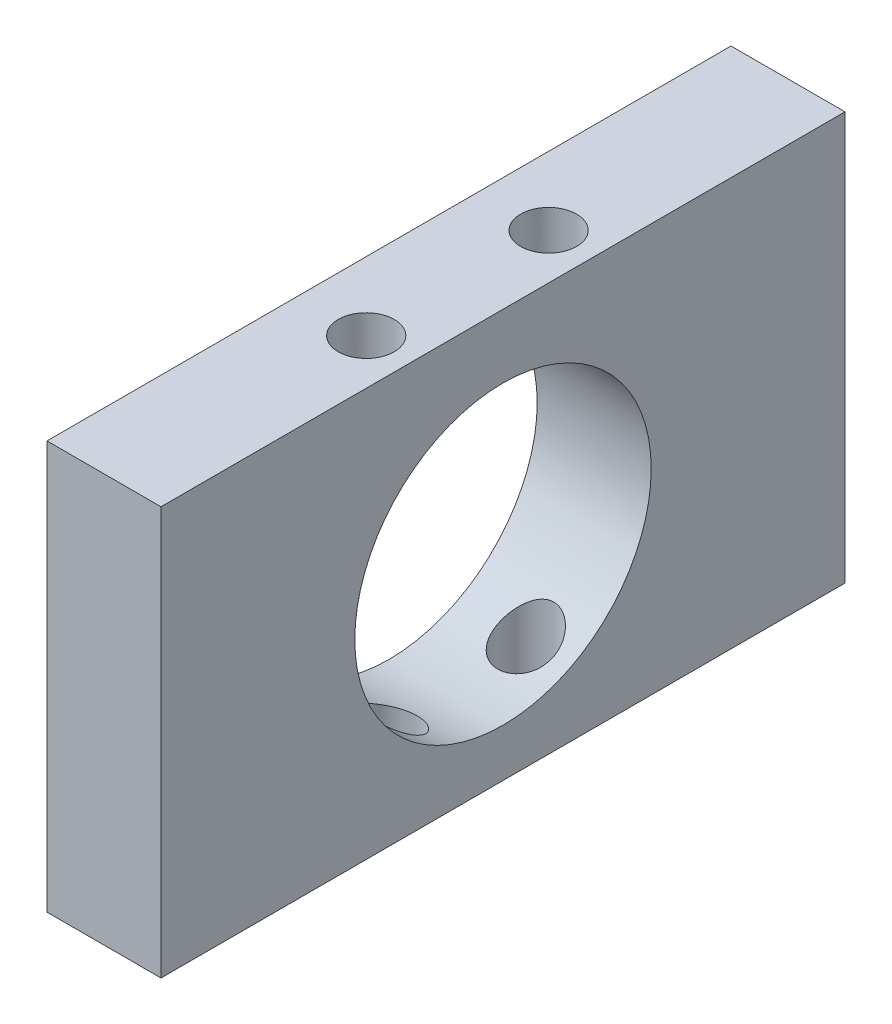
ISO-10303-21;
HEADER;
FILE_DESCRIPTION(('STEP AP214'),'2;1');
FILE_NAME('part.step','',(''),(''),'','','');
FILE_SCHEMA(('AUTOMOTIVE_DESIGN { 1 0 10303 214 1 1 1 1 }'));
ENDSEC;
DATA;
#1=APPLICATION_CONTEXT('core data for automotive mechanical design processes');
#2=APPLICATION_PROTOCOL_DEFINITION('international standard','automotive_design',2000,#1);
#3=PRODUCT_CONTEXT('',#1,'mechanical');
#4=PRODUCT('Part','Part','',(#3));
#5=PRODUCT_RELATED_PRODUCT_CATEGORY('part','',(#4));
#6=PRODUCT_DEFINITION_FORMATION('','',#4);
#7=PRODUCT_DEFINITION_CONTEXT('part definition',#1,'design');
#8=PRODUCT_DEFINITION('design','',#6,#7);
#9=PRODUCT_DEFINITION_SHAPE('','',#8);
#10=(LENGTH_UNIT() NAMED_UNIT(*) SI_UNIT(.MILLI.,.METRE.));
#11=(NAMED_UNIT(*) PLANE_ANGLE_UNIT() SI_UNIT($,.RADIAN.));
#12=(NAMED_UNIT(*) SI_UNIT($,.STERADIAN.) SOLID_ANGLE_UNIT());
#13=UNCERTAINTY_MEASURE_WITH_UNIT(LENGTH_MEASURE(1.E-05),#10,'distance_accuracy_value','');
#14=(GEOMETRIC_REPRESENTATION_CONTEXT(3) GLOBAL_UNCERTAINTY_ASSIGNED_CONTEXT((#13)) GLOBAL_UNIT_ASSIGNED_CONTEXT((#10,
#11,#12)) REPRESENTATION_CONTEXT('',''));
#15=CARTESIAN_POINT('',(0.,0.,0.));
#16=DIRECTION('',(0.,0.,1.));
#17=DIRECTION('',(1.,0.,0.));
#18=AXIS2_PLACEMENT_3D('',#15,#16,#17);
#19=CARTESIAN_POINT('',(0.5,-3.09999999990396,4.));
#20=DIRECTION('',(0.,-1.,0.));
#21=DIRECTION('',(0.,0.,-1.));
#22=AXIS2_PLACEMENT_3D('',#19,#20,#21);
#23=CONICAL_SURFACE('',#22,1.22949999978669,1.04719755081557);
#24=CARTESIAN_POINT('',(0.5,-3.1,4.));
#25=DIRECTION('',(0.,1.,0.));
#26=DIRECTION('',(0.,0.,1.));
#27=AXIS2_PLACEMENT_3D('',#24,#25,#26);
#28=CIRCLE('',#27,1.2295);
#29=CARTESIAN_POINT('',(0.5,-3.1,5.2295));
#30=VERTEX_POINT('',#29);
#31=EDGE_CURVE('E179',#30,#30,#28,.F.);
#32=ORIENTED_EDGE('',*,*,#31,.T.);
#33=EDGE_LOOP('',(#32));
#34=FACE_BOUND('',#33,.T.);
#35=CARTESIAN_POINT('',(0.500000000028422,-2.39014784395408,3.99999999997158));
#36=VERTEX_POINT('',#35);
#37=VERTEX_LOOP('',#36);
#38=FACE_BOUND('',#37,.T.);
#39=ADVANCED_FACE('F17',(#34,#38),#23,.F.);
#40=CARTESIAN_POINT('',(0.5,-3.10000000001764,26.));
#41=DIRECTION('',(0.,-1.,0.));
#42=DIRECTION('',(0.,0.,-1.));
#43=AXIS2_PLACEMENT_3D('',#40,#41,#42);
#44=CONICAL_SURFACE('',#43,1.22949999999499,1.04719755118339);
#45=CARTESIAN_POINT('',(0.5,-3.1,26.));
#46=DIRECTION('',(0.,1.,0.));
#47=DIRECTION('',(0.,0.,1.));
#48=AXIS2_PLACEMENT_3D('',#45,#46,#47);
#49=CIRCLE('',#48,1.2295);
#50=CARTESIAN_POINT('',(0.5,-3.1,27.2295));
#51=VERTEX_POINT('',#50);
#52=EDGE_CURVE('E173',#51,#51,#49,.F.);
#53=ORIENTED_EDGE('',*,*,#52,.T.);
#54=EDGE_LOOP('',(#53));
#55=FACE_BOUND('',#54,.T.);
#56=CARTESIAN_POINT('',(0.5,-2.39014784403935,26.));
#57=VERTEX_POINT('',#56);
#58=VERTEX_LOOP('',#57);
#59=FACE_BOUND('',#58,.T.);
#60=ADVANCED_FACE('F69',(#55,#59),#44,.F.);
#61=CARTESIAN_POINT('',(0.,-1.,6.49999999995998));
#62=DIRECTION('',(0.,0.,-1.));
#63=DIRECTION('',(-1.,0.,0.));
#64=AXIS2_PLACEMENT_3D('',#61,#62,#63);
#65=CONICAL_SURFACE('',#64,0.783500000045757,1.04719755121255);
#66=CARTESIAN_POINT('',(0.,-1.,6.5));
#67=DIRECTION('',(0.,0.,1.));
#68=DIRECTION('',(1.,0.,0.));
#69=AXIS2_PLACEMENT_3D('',#66,#67,#68);
#70=CIRCLE('',#69,0.7835);
#71=CARTESIAN_POINT('',(0.7835,-1.,6.5));
#72=VERTEX_POINT('',#71);
#73=EDGE_CURVE('E171',#72,#72,#70,.F.);
#74=ORIENTED_EDGE('',*,*,#73,.T.);
#75=EDGE_LOOP('',(#74));
#76=FACE_BOUND('',#75,.T.);
#77=CARTESIAN_POINT('',(-8.52651303692523E-11,-1.00000000002842,6.9523539359011));
#78=VERTEX_POINT('',#77);
#79=VERTEX_LOOP('',#78);
#80=FACE_BOUND('',#79,.T.);
#81=ADVANCED_FACE('F74',(#76,#80),#65,.F.);
#82=CARTESIAN_POINT('',(0.,6.,6.50000000001683));
#83=DIRECTION('',(0.,0.,-1.));
#84=DIRECTION('',(0.,1.,0.));
#85=AXIS2_PLACEMENT_3D('',#82,#83,#84);
#86=CONICAL_SURFACE('',#85,0.783499999921133,1.04719755093472);
#87=CARTESIAN_POINT('',(0.,6.,6.5));
#88=DIRECTION('',(0.,0.,1.));
#89=DIRECTION('',(1.,0.,0.));
#90=AXIS2_PLACEMENT_3D('',#87,#88,#89);
#91=CIRCLE('',#90,0.7835);
#92=CARTESIAN_POINT('',(0.7835,6.,6.5));
#93=VERTEX_POINT('',#92);
#94=EDGE_CURVE('E172',#93,#93,#91,.F.);
#95=ORIENTED_EDGE('',*,*,#94,.T.);
#96=EDGE_LOOP('',(#95));
#97=FACE_BOUND('',#96,.T.);
#98=CARTESIAN_POINT('',(0.,6.,6.95235393595794));
#99=VERTEX_POINT('',#98);
#100=VERTEX_LOOP('',#99);
#101=FACE_BOUND('',#100,.T.);
#102=ADVANCED_FACE('F159',(#97,#101),#86,.F.);
#103=CARTESIAN_POINT('',(0.5,-8.5,4.));
#104=DIRECTION('',(0.,1.,0.));
#105=DIRECTION('',(0.,0.,1.));
#106=AXIS2_PLACEMENT_3D('',#103,#104,#105);
#107=CYLINDRICAL_SURFACE('',#106,1.2295);
#108=ORIENTED_EDGE('',*,*,#31,.F.);
#109=EDGE_LOOP('',(#108));
#110=FACE_BOUND('',#109,.T.);
#111=CARTESIAN_POINT('',(0.5,-8.6,4.));
#112=DIRECTION('',(0.,1.,0.));
#113=DIRECTION('',(0.,0.,1.));
#114=AXIS2_PLACEMENT_3D('',#111,#112,#113);
#115=CIRCLE('',#114,1.2295);
#116=CARTESIAN_POINT('',(0.5,-8.6,5.2295));
#117=VERTEX_POINT('',#116);
#118=EDGE_CURVE('E20',#117,#117,#115,.T.);
#119=ORIENTED_EDGE('',*,*,#118,.F.);
#120=EDGE_LOOP('',(#119));
#121=FACE_BOUND('',#120,.T.);
#122=ADVANCED_FACE('F155',(#110,#121),#107,.F.);
#123=CARTESIAN_POINT('',(0.5,-8.5,26.));
#124=DIRECTION('',(0.,1.,0.));
#125=DIRECTION('',(0.,0.,1.));
#126=AXIS2_PLACEMENT_3D('',#123,#124,#125);
#127=CYLINDRICAL_SURFACE('',#126,1.2295);
#128=ORIENTED_EDGE('',*,*,#52,.F.);
#129=EDGE_LOOP('',(#128));
#130=FACE_BOUND('',#129,.T.);
#131=CARTESIAN_POINT('',(0.5,-8.6,26.));
#132=DIRECTION('',(0.,1.,0.));
#133=DIRECTION('',(0.,0.,1.));
#134=AXIS2_PLACEMENT_3D('',#131,#132,#133);
#135=CIRCLE('',#134,1.2295);
#136=CARTESIAN_POINT('',(0.5,-8.6,27.2295));
#137=VERTEX_POINT('',#136);
#138=EDGE_CURVE('E189',#137,#137,#135,.T.);
#139=ORIENTED_EDGE('',*,*,#138,.F.);
#140=EDGE_LOOP('',(#139));
#141=FACE_BOUND('',#140,.T.);
#142=ADVANCED_FACE('F151',(#130,#141),#127,.F.);
#143=CARTESIAN_POINT('',(0.,-1.,0.1));
#144=DIRECTION('',(0.,0.,1.));
#145=DIRECTION('',(1.,0.,0.));
#146=AXIS2_PLACEMENT_3D('',#143,#144,#145);
#147=CYLINDRICAL_SURFACE('',#146,0.7835);
#148=ORIENTED_EDGE('',*,*,#73,.F.);
#149=EDGE_LOOP('',(#148));
#150=FACE_BOUND('',#149,.T.);
#151=CARTESIAN_POINT('',(0.,-1.,0.));
#152=DIRECTION('',(0.,0.,1.));
#153=DIRECTION('',(1.,0.,0.));
#154=AXIS2_PLACEMENT_3D('',#151,#152,#153);
#155=CIRCLE('',#154,0.7835);
#156=CARTESIAN_POINT('',(0.7835,-1.,0.));
#157=VERTEX_POINT('',#156);
#158=EDGE_CURVE('E200',#157,#157,#155,.F.);
#159=ORIENTED_EDGE('',*,*,#158,.T.);
#160=EDGE_LOOP('',(#159));
#161=FACE_BOUND('',#160,.T.);
#162=ADVANCED_FACE('F147',(#150,#161),#147,.F.);
#163=CARTESIAN_POINT('',(0.,6.,0.1));
#164=DIRECTION('',(0.,0.,1.));
#165=DIRECTION('',(1.,0.,0.));
#166=AXIS2_PLACEMENT_3D('',#163,#164,#165);
#167=CYLINDRICAL_SURFACE('',#166,0.7835);
#168=ORIENTED_EDGE('',*,*,#94,.F.);
#169=EDGE_LOOP('',(#168));
#170=FACE_BOUND('',#169,.T.);
#171=CARTESIAN_POINT('',(0.,6.,0.));
#172=DIRECTION('',(0.,0.,1.));
#173=DIRECTION('',(1.,0.,0.));
#174=AXIS2_PLACEMENT_3D('',#171,#172,#173);
#175=CIRCLE('',#174,0.7835);
#176=CARTESIAN_POINT('',(0.7835,6.,0.));
#177=VERTEX_POINT('',#176);
#178=EDGE_CURVE('E205',#177,#177,#175,.F.);
#179=ORIENTED_EDGE('',*,*,#178,.T.);
#180=EDGE_LOOP('',(#179));
#181=FACE_BOUND('',#180,.T.);
#182=ADVANCED_FACE('F143',(#170,#181),#167,.F.);
#183=CARTESIAN_POINT('',(0.5,-8.5,12.));
#184=DIRECTION('',(0.,1.,0.));
#185=DIRECTION('',(0.,0.,1.));
#186=AXIS2_PLACEMENT_3D('',#183,#184,#185);
#187=CYLINDRICAL_SURFACE('',#186,1.2295);
#188=CARTESIAN_POINT('',(0.5,-8.6,12.));
#189=DIRECTION('',(0.,1.,0.));
#190=DIRECTION('',(0.,0.,1.));
#191=AXIS2_PLACEMENT_3D('',#188,#189,#190);
#192=CIRCLE('',#191,1.2295);
#193=CARTESIAN_POINT('',(0.5,-8.6,13.2295));
#194=VERTEX_POINT('',#193);
#195=EDGE_CURVE('E187',#194,#194,#192,.T.);
#196=ORIENTED_EDGE('',*,*,#195,.F.);
#197=EDGE_LOOP('',(#196));
#198=FACE_BOUND('',#197,.T.);
#199=CARTESIAN_POINT('',(1.57898775984839,-5.41902409458247,11.4105463002938));
#200=CARTESIAN_POINT('',(1.54350432210785,-5.37599821195079,11.3455925201877));
#201=CARTESIAN_POINT('',(1.50204506316841,-5.33326068973784,11.2836253624419));
#202=CARTESIAN_POINT('',(1.40757477362818,-5.25019426157183,11.1671706197702));
#203=CARTESIAN_POINT('',(1.35455410070056,-5.2098674021196,11.1126893403358));
#204=CARTESIAN_POINT('',(1.24864924326198,-5.14139341362122,11.022735600131));
#205=CARTESIAN_POINT('',(1.19771083739972,-5.1123972583103,10.9856235285672));
#206=CARTESIAN_POINT('',(1.08891989363457,-5.05924619660192,10.9188425524561));
#207=CARTESIAN_POINT('',(1.03107957831365,-5.03508292897328,10.8891607702044));
#208=CARTESIAN_POINT('',(0.920263419551336,-4.99725015926502,10.8432927666009));
#209=CARTESIAN_POINT('',(0.868275646137892,-4.98247584655016,10.8256408736812));
#210=CARTESIAN_POINT('',(0.76118263886178,-4.95858511096861,10.7972888123839));
#211=CARTESIAN_POINT('',(0.706079654882526,-4.9494646602919,10.7865836948702));
#212=CARTESIAN_POINT('',(0.593968995715319,-4.9376908760812,10.7727910059167));
#213=CARTESIAN_POINT('',(0.536953813354866,-4.93506707089065,10.7697382148104));
#214=CARTESIAN_POINT('',(0.423148097071325,-4.93664986546514,10.7715854863549));
#215=CARTESIAN_POINT('',(0.366357562570627,-4.94085644765658,10.7764855285442));
#216=CARTESIAN_POINT('',(0.258843048875742,-4.95512840061852,10.7932425007076));
#217=CARTESIAN_POINT('',(0.207975639780494,-4.9647533585245,10.804576957771));
#218=CARTESIAN_POINT('',(0.109123056898987,-4.98875932552672,10.8331515058891));
#219=CARTESIAN_POINT('',(0.0611387463715604,-5.00314175080315,10.8503933554828));
#220=CARTESIAN_POINT('',(-0.0357126065090727,-5.03735064492044,10.8919727224218));
#221=CARTESIAN_POINT('',(-0.0842118191907645,-5.0575704806824,10.9168371658984));
#222=CARTESIAN_POINT('',(-0.176367164746679,-5.10149846874345,10.9718547964386));
#223=CARTESIAN_POINT('',(-0.220020588435676,-5.12520855531499,11.0020109179043));
#224=CARTESIAN_POINT('',(-0.311029574990962,-5.18044664917986,11.0737513012166));
#225=CARTESIAN_POINT('',(-0.357187379489805,-5.21256327894721,11.1164010474486));
#226=CARTESIAN_POINT('',(-0.44182626541927,-5.27901796857915,11.2072246169204));
#227=CARTESIAN_POINT('',(-0.480301539485361,-5.31335768314416,11.2554025760446));
#228=CARTESIAN_POINT('',(-0.55651916290933,-5.39032989383123,11.3668451915277));
#229=CARTESIAN_POINT('',(-0.592470082266699,-5.43321073608699,11.4311710053382));
#230=CARTESIAN_POINT('',(-0.652410668592677,-5.51894600940814,11.5652397263585));
#231=CARTESIAN_POINT('',(-0.676391423278033,-5.56180039713848,11.6349866252724));
#232=CARTESIAN_POINT('',(-0.713133306555228,-5.64971478565478,11.7845897382531));
#233=CARTESIAN_POINT('',(-0.724765172778964,-5.69465186497651,11.8648010546297));
#234=CARTESIAN_POINT('',(-0.73188130826498,-5.7813105835457,12.0276392102505));
#235=CARTESIAN_POINT('',(-0.727379400054598,-5.82303494397735,12.1102639216551));
#236=CARTESIAN_POINT('',(-0.703550442095634,-5.89498833167978,12.2605107240223));
#237=CARTESIAN_POINT('',(-0.68696436206692,-5.92594957363092,12.3282204885315));
#238=CARTESIAN_POINT('',(-0.641866650594575,-5.98413611813288,12.461226869342));
#239=CARTESIAN_POINT('',(-0.613364570008473,-6.01136438955876,12.5265253727893));
#240=CARTESIAN_POINT('',(-0.547362796767616,-6.05961306624789,12.647344644393));
#241=CARTESIAN_POINT('',(-0.51076599782364,-6.08095593147471,12.7032296876123));
#242=CARTESIAN_POINT('',(-0.428195515355715,-6.11989324846667,12.8090894755991));
#243=CARTESIAN_POINT('',(-0.382222794309946,-6.13748808460418,12.8590648261904));
#244=CARTESIAN_POINT('',(-0.281841423266512,-6.16890478324075,12.9513415635376));
#245=CARTESIAN_POINT('',(-0.227417135405773,-6.18271951786405,12.9936284029268));
#246=CARTESIAN_POINT('',(-0.111667682884761,-6.2066057618282,13.068781073762));
#247=CARTESIAN_POINT('',(-0.0503427672831287,-6.2166774062089,13.1016472450685));
#248=CARTESIAN_POINT('',(0.0753811472161405,-6.23295757483474,13.1558149288152));
#249=CARTESIAN_POINT('',(0.139623877811625,-6.239277133663,13.1774461752801));
#250=CARTESIAN_POINT('',(0.271013177360598,-6.24866092678786,13.2098812675966));
#251=CARTESIAN_POINT('',(0.338159437058305,-6.2517255068888,13.2206862636068));
#252=CARTESIAN_POINT('',(0.472278218445995,-6.25465065472998,13.23099648567));
#253=CARTESIAN_POINT('',(0.539235777749875,-6.25456256308144,13.2306827783367));
#254=CARTESIAN_POINT('',(0.672137920337513,-6.25130720362538,13.2192156195178));
#255=CARTESIAN_POINT('',(0.738082549849662,-6.24814007676645,13.2080626642189));
#256=CARTESIAN_POINT('',(0.866919049053705,-6.23866468975215,13.1753496152046));
#257=CARTESIAN_POINT('',(0.929818281383807,-6.23236446810774,13.1538161588171));
#258=CARTESIAN_POINT('',(1.05099164550827,-6.21650790800161,13.1011102008028));
#259=CARTESIAN_POINT('',(1.10926586093143,-6.20695162843194,13.0699378735145));
#260=CARTESIAN_POINT('',(1.22002806535931,-6.18438182691165,12.9987957670162));
#261=CARTESIAN_POINT('',(1.27247158086911,-6.17134401260534,12.958764524669));
#262=CARTESIAN_POINT('',(1.36977887880723,-6.14177541771875,12.871452519272));
#263=CARTESIAN_POINT('',(1.41464216961134,-6.1252444107398,12.8241712863947));
#264=CARTESIAN_POINT('',(1.49686215820002,-6.08826104166058,12.7227077787526));
#265=CARTESIAN_POINT('',(1.53400105465718,-6.06772031336202,12.6683815560593));
#266=CARTESIAN_POINT('',(1.5987160699721,-6.02318173947681,12.5556277036303));
#267=CARTESIAN_POINT('',(1.62629079913051,-5.99918339220522,12.4971994793445));
#268=CARTESIAN_POINT('',(1.67300182793662,-5.94657170043665,12.3745504629248));
#269=CARTESIAN_POINT('',(1.6915592406161,-5.91777193863258,12.3101899792936));
#270=CARTESIAN_POINT('',(1.71794995279774,-5.85717643428948,12.180672989839));
#271=CARTESIAN_POINT('',(1.72577592942421,-5.82537866177731,12.1155159710377));
#272=CARTESIAN_POINT('',(1.73138502680717,-5.75626345719039,11.9797728666958));
#273=CARTESIAN_POINT('',(1.72813210796464,-5.7187091759983,11.9092659559444));
#274=CARTESIAN_POINT('',(1.70998000822607,-5.64173830125455,11.7709054767745));
#275=CARTESIAN_POINT('',(1.69509044921725,-5.6023232715714,11.7030497648318));
#276=CARTESIAN_POINT('',(1.66260229994343,-5.53872941113296,11.5978538030797));
#277=CARTESIAN_POINT('',(1.64851204611553,-5.51480994808403,11.5592335686854));
#278=CARTESIAN_POINT('',(1.61655880006442,-5.46690538181314,11.4836169853501));
#279=CARTESIAN_POINT('',(1.59869492696981,-5.44292026455814,11.4466210179995));
#280=CARTESIAN_POINT('',(1.57898775984839,-5.41902409458247,11.4105463002938));
#281=B_SPLINE_CURVE_WITH_KNOTS('',3,(#199,#200,#201,#202,#203,#204,#205,#206,#207,#208,#209,
#210,#211,#212,#213,#214,#215,#216,#217,#218,#219,#220,#221,#222,#223,#224,#225,#226,#227,#228,
#229,#230,#231,#232,#233,#234,#235,#236,#237,#238,#239,#240,#241,#242,#243,#244,#245,#246,#247,
#248,#249,#250,#251,#252,#253,#254,#255,#256,#257,#258,#259,#260,#261,#262,#263,#264,#265,#266,
#267,#268,#269,#270,#271,#272,#273,#274,#275,#276,#277,#278,#279,#280),.UNSPECIFIED.,.T.,.F.,(4,
2,2,2,2,2,2,2,2,2,2,2,2,2,2,2,2,2,2,2,2,2,2,2,2,2,2,2,2,2,2,2,2,2,2,2,2,2,2,2,4),(0.,
0.256682893556436,0.513580687453377,0.720933186011389,0.92792378683721,1.09779066198847,
1.26753638452808,1.43805222512036,1.60856762700073,1.76689106200559,1.92526166845095,
2.09903120590584,2.27289741032158,2.48386476625591,2.69499099749949,2.94970728613778,
3.20461293977311,3.48122444617692,3.75759902378707,3.98546148219753,4.21314165442931,
4.42259613866062,4.6320291323133,4.84185435965748,5.05167201638112,5.25492328833261,
5.45815296499554,5.65807461760425,5.85798711885631,6.05738933499007,6.25678794474348,
6.45761595459884,6.65845698439065,6.86436219347708,7.0702973086254,7.2881181638843,
7.50608758105155,7.74497830968524,7.98367171754203,8.12619767256448,8.2687569340857),.UNSPECIFIED.);
#282=CARTESIAN_POINT('',(1.57898775984839,-5.41902409458247,11.4105463002938));
#283=VERTEX_POINT('',#282);
#284=EDGE_CURVE('E103',#283,#283,#281,.T.);
#285=ORIENTED_EDGE('',*,*,#284,.T.);
#286=EDGE_LOOP('',(#285));
#287=FACE_BOUND('',#286,.T.);
#288=ADVANCED_FACE('F138',(#198,#287),#187,.F.);
#289=CARTESIAN_POINT('',(-2.5,0.,0.));
#290=DIRECTION('',(1.,0.,0.));
#291=DIRECTION('',(0.,0.,-1.));
#292=AXIS2_PLACEMENT_3D('',#289,#290,#291);
#293=PLANE('',#292);
#294=CARTESIAN_POINT('',(-2.5,0.,15.));
#295=DIRECTION('',(-1.,0.,0.));
#296=DIRECTION('',(0.,0.,1.));
#297=AXIS2_PLACEMENT_3D('',#294,#295,#296);
#298=CIRCLE('',#297,6.5);
#299=CARTESIAN_POINT('',(-2.5,0.,21.5));
#300=VERTEX_POINT('',#299);
#301=EDGE_CURVE('E264',#300,#300,#298,.F.);
#302=ORIENTED_EDGE('',*,*,#301,.T.);
#303=EDGE_LOOP('',(#302));
#304=FACE_BOUND('',#303,.T.);
#305=DIRECTION('',(0.,0.,1.));
#306=VECTOR('',#305,1.);
#307=CARTESIAN_POINT('',(-2.5,9.3,0.));
#308=LINE('',#307,#306);
#309=CARTESIAN_POINT('',(-2.5,9.3,0.));
#310=VERTEX_POINT('',#309);
#311=CARTESIAN_POINT('',(-2.5,9.3,30.));
#312=VERTEX_POINT('',#311);
#313=EDGE_CURVE('E204',#310,#312,#308,.T.);
#314=ORIENTED_EDGE('',*,*,#313,.F.);
#315=DIRECTION('',(0.,1.,0.));
#316=VECTOR('',#315,1.);
#317=CARTESIAN_POINT('',(-2.5,9.3,0.));
#318=LINE('',#317,#316);
#319=CARTESIAN_POINT('',(-2.5,-8.6,0.));
#320=VERTEX_POINT('',#319);
#321=EDGE_CURVE('E195',#310,#320,#318,.F.);
#322=ORIENTED_EDGE('',*,*,#321,.T.);
#323=DIRECTION('',(0.,0.,-1.));
#324=VECTOR('',#323,1.);
#325=CARTESIAN_POINT('',(-2.5,-8.6,30.));
#326=LINE('',#325,#324);
#327=CARTESIAN_POINT('',(-2.5,-8.6,30.));
#328=VERTEX_POINT('',#327);
#329=EDGE_CURVE('E176',#328,#320,#326,.T.);
#330=ORIENTED_EDGE('',*,*,#329,.F.);
#331=DIRECTION('',(0.,1.,0.));
#332=VECTOR('',#331,1.);
#333=CARTESIAN_POINT('',(-2.5,-8.6,30.));
#334=LINE('',#333,#332);
#335=EDGE_CURVE('E210',#328,#312,#334,.T.);
#336=ORIENTED_EDGE('',*,*,#335,.T.);
#337=EDGE_LOOP('',(#314,#322,#330,#336));
#338=FACE_BOUND('',#337,.T.);
#339=ADVANCED_FACE('F135',(#304,#338),#293,.F.);
#340=CARTESIAN_POINT('',(0.5,-8.5,18.));
#341=DIRECTION('',(0.,1.,0.));
#342=DIRECTION('',(0.,0.,1.));
#343=AXIS2_PLACEMENT_3D('',#340,#341,#342);
#344=CYLINDRICAL_SURFACE('',#343,1.2295);
#345=CARTESIAN_POINT('',(0.5,-8.6,18.));
#346=DIRECTION('',(0.,1.,0.));
#347=DIRECTION('',(0.,0.,1.));
#348=AXIS2_PLACEMENT_3D('',#345,#346,#347);
#349=CIRCLE('',#348,1.2295);
#350=CARTESIAN_POINT('',(0.5,-8.6,19.2295));
#351=VERTEX_POINT('',#350);
#352=EDGE_CURVE('E198',#351,#351,#349,.T.);
#353=ORIENTED_EDGE('',*,*,#352,.F.);
#354=EDGE_LOOP('',(#353));
#355=FACE_BOUND('',#354,.T.);
#356=CARTESIAN_POINT('',(-0.723990386822329,-5.70428665229942,18.1162660009054));
#357=CARTESIAN_POINT('',(-0.71605257924243,-5.65864586194395,18.1998038142645));
#358=CARTESIAN_POINT('',(-0.699633194745953,-5.61146654544813,18.2817628036225));
#359=CARTESIAN_POINT('',(-0.650980169549617,-5.51573374908336,18.4402468513578));
#360=CARTESIAN_POINT('',(-0.618702133773846,-5.46717677423605,18.5167559607372));
#361=CARTESIAN_POINT('',(-0.543443803162814,-5.37592794095522,18.6545174292743));
#362=CARTESIAN_POINT('',(-0.501943290451195,-5.33315563045112,18.7165282259437));
#363=CARTESIAN_POINT('',(-0.407456408723512,-5.25010578657321,18.8329471103009));
#364=CARTESIAN_POINT('',(-0.354487185498567,-5.20982464323143,18.8873663498429));
#365=CARTESIAN_POINT('',(-0.248659282046622,-5.14139949560272,18.9772567992892));
#366=CARTESIAN_POINT('',(-0.197734236126938,-5.11241044747399,19.0143597073944));
#367=CARTESIAN_POINT('',(-0.088946974061472,-5.05925767781497,19.0811432142376));
#368=CARTESIAN_POINT('',(-0.0310937453633821,-5.03508781093729,19.1108332780735));
#369=CARTESIAN_POINT('',(0.0797386360134181,-4.99724942031111,19.1567081562813));
#370=CARTESIAN_POINT('',(0.131728528301767,-4.98247465182335,19.1743605616259));
#371=CARTESIAN_POINT('',(0.238821747009632,-4.95858439507857,19.2027120193717));
#372=CARTESIAN_POINT('',(0.293922572373048,-4.94946442934557,19.2134165734005));
#373=CARTESIAN_POINT('',(0.406030781604786,-4.93769089649485,19.2272089724566));
#374=CARTESIAN_POINT('',(0.463045731760984,-4.93506709038867,19.2302617630632));
#375=CARTESIAN_POINT('',(0.576851449532657,-4.93664983333935,19.2284145505085));
#376=CARTESIAN_POINT('',(0.633642215941538,-4.94085641910837,19.223514504602));
#377=CARTESIAN_POINT('',(0.741156537280442,-4.955128344891,19.2067575650693));
#378=CARTESIAN_POINT('',(0.792023545012496,-4.96475320269012,19.1954232265983));
#379=CARTESIAN_POINT('',(0.890876173173292,-4.98875909634767,19.1668487680003));
#380=CARTESIAN_POINT('',(0.938860884017555,-5.00314162439307,19.1496067949529));
#381=CARTESIAN_POINT('',(1.03571504456747,-5.03735150152469,19.1080262399366));
#382=CARTESIAN_POINT('',(1.08421648411926,-5.05757240866819,19.08316047676));
#383=CARTESIAN_POINT('',(1.17637138592532,-5.10150077706171,19.0281422550945));
#384=CARTESIAN_POINT('',(1.220022607631,-5.12520983800107,18.9979873697549));
#385=CARTESIAN_POINT('',(1.31101684501162,-5.18043885338421,18.9262588799158));
#386=CARTESIAN_POINT('',(1.35716372708046,-5.21254655295308,18.8836213842962));
#387=CARTESIAN_POINT('',(1.44180680932478,-5.2790008461425,18.7927992138193));
#388=CARTESIAN_POINT('',(1.48029328285754,-5.31335021355185,18.7446076077383));
#389=CARTESIAN_POINT('',(1.55656968438366,-5.39037986631824,18.6330832187581));
#390=CARTESIAN_POINT('',(1.59255568916136,-5.43330904195497,18.5686842645752));
#391=CARTESIAN_POINT('',(1.65247253376569,-5.51905867249136,18.4345750836046));
#392=CARTESIAN_POINT('',(1.67642387106933,-5.56187918781135,18.3648741220114));
#393=CARTESIAN_POINT('',(1.70111794512032,-5.62096448369346,18.2643364792157));
#394=CARTESIAN_POINT('',(1.70718515306986,-5.63784614943147,18.2350952235271));
#395=CARTESIAN_POINT('',(1.71719670269473,-5.67130990801311,18.1760660807034));
#396=CARTESIAN_POINT('',(1.72114013063633,-5.68789186895151,18.1462779639775));
#397=CARTESIAN_POINT('',(1.73076721305193,-5.74326721775175,18.0449089560418));
#398=CARTESIAN_POINT('',(1.7313642551097,-5.78118965386146,17.9722864905332));
#399=CARTESIAN_POINT('',(1.71938852870499,-5.8538529815031,17.8264877655383));
#400=CARTESIAN_POINT('',(1.70681498738326,-5.88859368619865,17.7533114738033));
#401=CARTESIAN_POINT('',(1.67497477035053,-5.94228204614117,17.6347464244642));
#402=CARTESIAN_POINT('',(1.65972158107862,-5.96242770589375,17.5887975043123));
#403=CARTESIAN_POINT('',(1.62357308239629,-6.00087592652321,17.4983791391085));
#404=CARTESIAN_POINT('',(1.60267940661335,-6.01917901895022,17.4539092698683));
#405=CARTESIAN_POINT('',(1.54738186950972,-6.05959438583432,17.3526978410994));
#406=CARTESIAN_POINT('',(1.51079644443473,-6.08093666899754,17.2968193256152));
#407=CARTESIAN_POINT('',(1.42822961882801,-6.11988207020963,17.1909442738373));
#408=CARTESIAN_POINT('',(1.38224187689732,-6.13748264823441,17.1409517434004));
#409=CARTESIAN_POINT('',(1.28183808780555,-6.16890529034372,17.0486563441149));
#410=CARTESIAN_POINT('',(1.22740901928897,-6.18272142400091,17.0063655787046));
#411=CARTESIAN_POINT('',(1.11165828735063,-6.20660746891301,16.9312135746504));
#412=CARTESIAN_POINT('',(1.05033791321934,-6.2166780794014,16.8983505762447));
#413=CARTESIAN_POINT('',(0.924619500390176,-6.23295744773638,16.8441854348073));
#414=CARTESIAN_POINT('',(0.860377398755883,-6.23927699628661,16.8225542772571));
#415=CARTESIAN_POINT('',(0.728988135008475,-6.24866087935202,16.7901189190157));
#416=CARTESIAN_POINT('',(0.6618412250123,-6.25172549578484,16.779313780661));
#417=CARTESIAN_POINT('',(0.527721793212887,-6.25465065119414,16.7690035217463));
#418=CARTESIAN_POINT('',(0.460764243115593,-6.25456256227095,16.7693172232235));
#419=CARTESIAN_POINT('',(0.327862099249264,-6.25130720541526,16.780784375432));
#420=CARTESIAN_POINT('',(0.261917459558107,-6.2481400774976,16.791937333264));
#421=CARTESIAN_POINT('',(0.13308123624904,-6.23866471069583,16.8246503124819));
#422=CARTESIAN_POINT('',(0.0701822768274931,-6.23236452469072,16.8461836489229));
#423=CARTESIAN_POINT('',(-0.0509911265923284,-6.21650799232649,16.8988895229466));
#424=CARTESIAN_POINT('',(-0.109265613261222,-6.20695167601641,16.9300619715749));
#425=CARTESIAN_POINT('',(-0.220030126079923,-6.18438140990614,17.0012055523792));
#426=CARTESIAN_POINT('',(-0.272475474032583,-6.17134305596698,17.0412384306088));
#427=CARTESIAN_POINT('',(-0.369782214477703,-6.14177417786404,17.1285510119383));
#428=CARTESIAN_POINT('',(-0.414643676800199,-6.12524368585791,17.1758306483048));
#429=CARTESIAN_POINT('',(-0.496854102104281,-6.08826471348184,17.277282203002));
#430=CARTESIAN_POINT('',(-0.533986682534081,-6.06772844657454,17.331597125188));
#431=CARTESIAN_POINT('',(-0.59870532498936,-6.0231908932119,17.4443498509823));
#432=CARTESIAN_POINT('',(-0.626286295129277,-5.99918776823435,17.5027898337057));
#433=CARTESIAN_POINT('',(-0.673022718154656,-5.94654890895862,17.6255031827094));
#434=CARTESIAN_POINT('',(-0.691591749104472,-5.91772444646879,17.6899178794804));
#435=CARTESIAN_POINT('',(-0.717963206339883,-5.85711879875778,17.8194438406034));
#436=CARTESIAN_POINT('',(-0.725776889150919,-5.82534074201707,17.884554304708));
#437=CARTESIAN_POINT('',(-0.730772325883008,-5.76383578023385,18.0053586406181));
#438=CARTESIAN_POINT('',(-0.729226980006371,-5.73439600545318,18.0611558789173));
#439=CARTESIAN_POINT('',(-0.723990386822329,-5.70428665229942,18.1162660009054));
#440=B_SPLINE_CURVE_WITH_KNOTS('',3,(#356,#357,#358,#359,#360,#361,#362,#363,#364,#365,#366,
#367,#368,#369,#370,#371,#372,#373,#374,#375,#376,#377,#378,#379,#380,#381,#382,#383,#384,#385,
#386,#387,#388,#389,#390,#391,#392,#393,#394,#395,#396,#397,#398,#399,#400,#401,#402,#403,#404,
#405,#406,#407,#408,#409,#410,#411,#412,#413,#414,#415,#416,#417,#418,#419,#420,#421,#422,#423,
#424,#425,#426,#427,#428,#429,#430,#431,#432,#433,#434,#435,#436,#437,#438,#439),.UNSPECIFIED.,
.T.,.F.,(4,2,2,2,2,2,2,2,2,2,2,2,2,2,2,2,2,2,2,2,2,2,2,2,2,2,2,2,2,2,2,2,2,2,2,2,2,2,2,2,2,4),
(0.,0.286326942146408,0.573460041344221,0.830441215475632,1.08704082178239,1.29434539190049,
1.50138389548414,1.67125753483088,1.84099649579338,2.01151165879556,2.18202773828982,
2.34034990770468,2.49872178014998,2.67249967695402,2.84635751926756,3.05727125984933,
3.268451118899,3.52348001513042,3.77807306048576,3.88093072438526,3.98383260641859,
4.22849418337536,4.47317011805309,4.63016060615452,4.78710567453163,4.99647856742033,
5.20599314060829,5.4158341801108,5.62563602572468,5.82888530269361,6.03211697430834,
6.23203859659904,6.43195112816901,6.63135246118512,6.8307519540849,7.03158739824364,
7.232420993072,7.43828636995843,7.64426132367078,7.86227061130857,8.08005155693686,
8.26894221705419),.UNSPECIFIED.);
#441=CARTESIAN_POINT('',(-0.723990386822329,-5.70428665229942,18.1162660009054));
#442=VERTEX_POINT('',#441);
#443=EDGE_CURVE('E95',#442,#442,#440,.T.);
#444=ORIENTED_EDGE('',*,*,#443,.T.);
#445=EDGE_LOOP('',(#444));
#446=FACE_BOUND('',#445,.T.);
#447=ADVANCED_FACE('F130',(#355,#446),#344,.F.);
#448=CARTESIAN_POINT('',(0.5,9.2,11.));
#449=DIRECTION('',(0.,-1.,0.));
#450=DIRECTION('',(0.,0.,-1.));
#451=AXIS2_PLACEMENT_3D('',#448,#449,#450);
#452=CYLINDRICAL_SURFACE('',#451,1.2295);
#453=CARTESIAN_POINT('',(1.57898775984814,5.53336913042638,11.5894536997067));
#454=CARTESIAN_POINT('',(1.55022866573816,5.56582191015327,11.6421016461696));
#455=CARTESIAN_POINT('',(1.51714081317935,5.59645267323161,11.6934948847473));
#456=CARTESIAN_POINT('',(1.44232967629662,5.65358049169616,11.7921552784212));
#457=CARTESIAN_POINT('',(1.40061033708632,5.68007942590963,11.8394243045492));
#458=CARTESIAN_POINT('',(1.31021547281846,5.72784700427742,11.9268596336766));
#459=CARTESIAN_POINT('',(1.26175562466712,5.74923649167555,11.9671819841549));
#460=CARTESIAN_POINT('',(1.1579627831667,5.78735751914922,12.0405731410862));
#461=CARTESIAN_POINT('',(1.10263000553539,5.80408920536381,12.0736421751058));
#462=CARTESIAN_POINT('',(0.986276235939389,5.83271392007708,12.131117272525));
#463=CARTESIAN_POINT('',(0.925240869230277,5.84459429195258,12.1555006550069));
#464=CARTESIAN_POINT('',(0.799345324708439,5.86332910863179,12.1943197313177));
#465=CARTESIAN_POINT('',(0.734485567555265,5.870184105086,12.2087565170039));
#466=CARTESIAN_POINT('',(0.605664377398207,5.87863711329203,12.2266051167001));
#467=CARTESIAN_POINT('',(0.541775409818782,5.88043942197547,12.2304452812153));
#468=CARTESIAN_POINT('',(0.414221572068856,5.87936310239481,12.2281609773836));
#469=CARTESIAN_POINT('',(0.350556669866492,5.87648517291413,12.2220379965851));
#470=CARTESIAN_POINT('',(0.226479994104492,5.86616494462714,12.2003130005974));
#471=CARTESIAN_POINT('',(0.166029828251549,5.85880806499634,12.1848884293614));
#472=CARTESIAN_POINT('',(0.0487861494409157,5.83966119809518,12.1453834541492));
#473=CARTESIAN_POINT('',(-0.00800761975352605,5.82787152186787,12.1213036575031));
#474=CARTESIAN_POINT('',(-0.11684896001633,5.79988852715625,12.0653327543654));
#475=CARTESIAN_POINT('',(-0.168867181035658,5.78367013398602,12.0333972755951));
#476=CARTESIAN_POINT('',(-0.266685439994991,5.7470522642379,11.9630670181667));
#477=CARTESIAN_POINT('',(-0.312482962616484,5.72665110468989,11.9246696406288));
#478=CARTESIAN_POINT('',(-0.407527517555006,5.67642127825559,11.8327295325798));
#479=CARTESIAN_POINT('',(-0.454852272326092,5.64550802115122,11.7777845780883));
#480=CARTESIAN_POINT('',(-0.538013333902247,5.57828546165988,11.6627596610384));
#481=CARTESIAN_POINT('',(-0.573839019761738,5.54197121576377,11.6026750157693));
#482=CARTESIAN_POINT('',(-0.633873372831174,5.46501847347517,11.4802317945463));
#483=CARTESIAN_POINT('',(-0.658154070860844,5.42440877491619,11.4178900012334));
#484=CARTESIAN_POINT('',(-0.695991671143292,5.33950507192909,11.2925175066493));
#485=CARTESIAN_POINT('',(-0.709546573505437,5.29521038211238,11.2294866791236));
#486=CARTESIAN_POINT('',(-0.728008762390481,5.19678806467644,11.0947003476284));
#487=CARTESIAN_POINT('',(-0.731293169310349,5.14218787473729,11.0230710975736));
#488=CARTESIAN_POINT('',(-0.725891869227587,5.03031020908287,10.8824688996745));
#489=CARTESIAN_POINT('',(-0.717205394596156,4.9730325619041,10.8134961224672));
#490=CARTESIAN_POINT('',(-0.690577819320067,4.86371357016266,10.6871784598774));
#491=CARTESIAN_POINT('',(-0.673844572726595,4.81184811940208,10.6294197586871));
#492=CARTESIAN_POINT('',(-0.632365526158565,4.70758175128881,10.5173065562425));
#493=CARTESIAN_POINT('',(-0.607614436899733,4.65518050263641,10.46295433053));
#494=CARTESIAN_POINT('',(-0.541450462641475,4.53440297888904,10.3418252327568));
#495=CARTESIAN_POINT('',(-0.497249369334166,4.46613125930497,10.276447070326));
#496=CARTESIAN_POINT('',(-0.395344329877928,4.33249886116273,10.1535943059425));
#497=CARTESIAN_POINT('',(-0.337649935907952,4.26713616203347,10.0961141583136));
#498=CARTESIAN_POINT('',(-0.231600354703248,4.16618010352991,10.0104515194546));
#499=CARTESIAN_POINT('',(-0.187644840410422,4.12849621828761,9.97928084746491));
#500=CARTESIAN_POINT('',(-0.0934152075760815,4.05754854790354,9.92177509116173));
#501=CARTESIAN_POINT('',(-0.0431503596349147,4.02427842200848,9.89543304885176));
#502=CARTESIAN_POINT('',(0.0517482287427961,3.97139692776423,9.85423791653691));
#503=CARTESIAN_POINT('',(0.0950555200680478,3.95040064785514,9.83813463126255));
#504=CARTESIAN_POINT('',(0.18535655207273,3.91404036504303,9.81050953734329));
#505=CARTESIAN_POINT('',(0.232344188179554,3.89866726551975,9.7989803266363));
#506=CARTESIAN_POINT('',(0.32109403238546,3.87710732577796,9.78289438962519));
#507=CARTESIAN_POINT('',(0.362432853742831,3.86982076018071,9.77749914116482));
#508=CARTESIAN_POINT('',(0.446048204547464,3.8609949439416,9.77097041847101));
#509=CARTESIAN_POINT('',(0.488324068208408,3.8594517363914,9.76983401008977));
#510=CARTESIAN_POINT('',(0.572564350636964,3.86227667993563,9.77191994841721));
#511=CARTESIAN_POINT('',(0.614528754992404,3.86664510288555,9.7751424955792));
#512=CARTESIAN_POINT('',(0.696996568944311,3.88083034612345,9.78567055351364));
#513=CARTESIAN_POINT('',(0.737498667599737,3.89065193198044,9.79297963558547));
#514=CARTESIAN_POINT('',(0.828685735237436,3.91872128110288,9.81405589140708));
#515=CARTESIAN_POINT('',(0.87854456963644,3.93865090650266,9.82913391202716));
#516=CARTESIAN_POINT('',(0.973625571301652,3.98432979152924,9.86424797786796));
#517=CARTESIAN_POINT('',(1.018837186244,4.01009188809291,9.88429496888059));
#518=CARTESIAN_POINT('',(1.12636362114233,4.07974619760339,9.93951592009472));
#519=CARTESIAN_POINT('',(1.18570995103204,4.12620318783694,9.97720289403962));
#520=CARTESIAN_POINT('',(1.29466220997671,4.22421261455811,10.0593360555165));
#521=CARTESIAN_POINT('',(1.3442462877576,4.27577610225707,10.1037970199994));
#522=CARTESIAN_POINT('',(1.45251131724931,4.40280653380924,10.2172058974781));
#523=CARTESIAN_POINT('',(1.50687935148334,4.47957435781516,10.2888282233489));
#524=CARTESIAN_POINT('',(1.59866901748945,4.63436206662596,10.4409957843814));
#525=CARTESIAN_POINT('',(1.6360771045965,4.71238290081485,10.5215480875963));
#526=CARTESIAN_POINT('',(1.69339843365079,4.867756609166,10.6909079954443));
#527=CARTESIAN_POINT('',(1.71313410153686,4.94509513759119,10.7797896913444));
#528=CARTESIAN_POINT('',(1.73237580930856,5.09573703180863,10.9629898591607));
#529=CARTESIAN_POINT('',(1.73191320591952,5.16904647537045,11.0572996768788));
#530=CARTESIAN_POINT('',(1.71082382007224,5.2928778305366,11.2259095712888));
#531=CARTESIAN_POINT('',(1.69487734892767,5.34475304608011,11.2998020889726));
#532=CARTESIAN_POINT('',(1.64818074226544,5.44328918783884,11.4463613452729));
#533=CARTESIAN_POINT('',(1.61745689755711,5.48995919381367,11.5190300245092));
#534=CARTESIAN_POINT('',(1.57898775984814,5.53336913042638,11.5894536997067));
#535=B_SPLINE_CURVE_WITH_KNOTS('',3,(#453,#454,#455,#456,#457,#458,#459,#460,#461,#462,#463,
#464,#465,#466,#467,#468,#469,#470,#471,#472,#473,#474,#475,#476,#477,#478,#479,#480,#481,#482,
#483,#484,#485,#486,#487,#488,#489,#490,#491,#492,#493,#494,#495,#496,#497,#498,#499,#500,#501,
#502,#503,#504,#505,#506,#507,#508,#509,#510,#511,#512,#513,#514,#515,#516,#517,#518,#519,#520,
#521,#522,#523,#524,#525,#526,#527,#528,#529,#530,#531,#532,#533,#534),.UNSPECIFIED.,.T.,.F.,(4,
2,2,2,2,2,2,2,2,2,2,2,2,2,2,2,2,2,2,2,2,2,2,2,2,2,2,2,2,2,2,2,2,2,2,2,2,2,2,2,4),(0.,
0.204400188697767,0.408707159668336,0.607554564668722,0.80639573010492,1.00575238918152,
1.20508716100322,1.39623715621566,1.58735861437879,1.77494459678543,1.96251741900557,
2.15117509379931,2.33990882603968,2.57506486516324,2.8104374818247,3.04432165329982,
3.27824942364939,3.54764751419709,3.81706288061168,4.05480982925192,4.29271393747989,
4.60467041081519,4.91640670880201,5.11320507858129,5.30971759591205,5.46145512197651,
5.61294608510372,5.73934781822025,5.86566245024453,5.99198289123992,6.11841389897751,
6.28479336506344,6.45154264557883,6.70293938210544,6.95489258843942,7.30777705254706,
7.66094284527746,8.01761870412335,8.37374086267823,8.64763898033972,8.9210515912059),.UNSPECIFIED.);
#536=CARTESIAN_POINT('',(1.57898775984814,5.53336913042638,11.5894536997067));
#537=VERTEX_POINT('',#536);
#538=EDGE_CURVE('E115',#537,#537,#535,.T.);
#539=ORIENTED_EDGE('',*,*,#538,.T.);
#540=EDGE_LOOP('',(#539));
#541=FACE_BOUND('',#540,.T.);
#542=CARTESIAN_POINT('',(0.5,9.3,11.));
#543=DIRECTION('',(0.,-1.,0.));
#544=DIRECTION('',(0.,0.,-1.));
#545=AXIS2_PLACEMENT_3D('',#542,#543,#544);
#546=CIRCLE('',#545,1.2295);
#547=CARTESIAN_POINT('',(0.5,9.3,9.7705));
#548=VERTEX_POINT('',#547);
#549=EDGE_CURVE('E211',#548,#548,#546,.T.);
#550=ORIENTED_EDGE('',*,*,#549,.F.);
#551=EDGE_LOOP('',(#550));
#552=FACE_BOUND('',#551,.T.);
#553=ADVANCED_FACE('F125',(#541,#552),#452,.F.);
#554=CARTESIAN_POINT('',(0.5,9.2,19.));
#555=DIRECTION('',(0.,-1.,0.));
#556=DIRECTION('',(0.,0.,-1.));
#557=AXIS2_PLACEMENT_3D('',#554,#555,#556);
#558=CYLINDRICAL_SURFACE('',#557,1.2295);
#559=CARTESIAN_POINT('',(1.57898775984595,4.60292458532745,19.5894536997107));
#560=CARTESIAN_POINT('',(1.54145395496529,4.53440884453893,19.6581686760801));
#561=CARTESIAN_POINT('',(1.49725496757799,4.46613988437087,19.7235445996024));
#562=CARTESIAN_POINT('',(1.39535088974343,4.33250617678373,19.8463993676364));
#563=CARTESIAN_POINT('',(1.33765374096223,4.267139748458,19.9038828242576));
#564=CARTESIAN_POINT('',(1.23159990755784,4.16617970050705,19.9895488062905));
#565=CARTESIAN_POINT('',(1.1876438053187,4.12849533717733,20.0207198764592));
#566=CARTESIAN_POINT('',(1.09341400075979,4.05754774093614,20.0782255532937));
#567=CARTESIAN_POINT('',(1.0431497203826,4.02427806359645,20.1045672317037));
#568=CARTESIAN_POINT('',(0.948251871983702,3.97139698558716,20.1457620373766));
#569=CARTESIAN_POINT('',(0.904944686907961,3.95040074861548,20.1618652911764));
#570=CARTESIAN_POINT('',(0.814643670890241,3.91404043749861,20.1894904086189));
#571=CARTESIAN_POINT('',(0.767655926702711,3.89866729328677,20.2010196527195));
#572=CARTESIAN_POINT('',(0.678905950297365,3.87710732168897,20.2171056133648));
#573=CARTESIAN_POINT('',(0.637567110663151,3.86982075397724,20.2225008634163));
#574=CARTESIAN_POINT('',(0.553951759047391,3.86099494253858,20.2290295825741));
#575=CARTESIAN_POINT('',(0.5116759136803,3.8594517369784,20.2301659894802));
#576=CARTESIAN_POINT('',(0.427435653081196,3.8622766798313,20.2280800516565));
#577=CARTESIAN_POINT('',(0.385471252368427,3.86664510211967,20.2248575049841));
#578=CARTESIAN_POINT('',(0.303003438147535,3.88083034440311,20.2143294477694));
#579=CARTESIAN_POINT('',(0.262501335842088,3.89065193091864,20.2070203652148));
#580=CARTESIAN_POINT('',(0.171314263408627,3.91872128152272,20.1859441082738));
#581=CARTESIAN_POINT('',(0.121455427776077,3.93865090755279,20.1708660871652));
#582=CARTESIAN_POINT('',(0.0263744263292504,3.98432979286134,20.1357520211082));
#583=CARTESIAN_POINT('',(-0.0188371874081925,4.01009188877608,20.1157050306242));
#584=CARTESIAN_POINT('',(-0.126363648829682,4.07974621564593,20.0604840655314));
#585=CARTESIAN_POINT('',(-0.185710001672371,4.12620322801598,20.0227970730489));
#586=CARTESIAN_POINT('',(-0.294662253104716,4.22421265873372,19.9406639066938));
#587=CARTESIAN_POINT('',(-0.344246308906854,4.2757761239972,19.8962029616125));
#588=CARTESIAN_POINT('',(-0.452511041263224,4.40280621429361,19.7827943863459));
#589=CARTESIAN_POINT('',(-0.50687886976692,4.47957369944894,19.7111723848659));
#590=CARTESIAN_POINT('',(-0.59866870210363,4.63436138107184,19.5590049287275));
#591=CARTESIAN_POINT('',(-0.636077014178954,4.71238253722811,19.4784523292747));
#592=CARTESIAN_POINT('',(-0.693399131715717,4.86775862100629,19.3090897908564));
#593=CARTESIAN_POINT('',(-0.713134978422507,4.9450991728636,19.2202055988227));
#594=CARTESIAN_POINT('',(-0.732375915640009,5.09574068073016,19.0370055070099));
#595=CARTESIAN_POINT('',(-0.73191338779495,5.1690479139382,18.9426985433519));
#596=CARTESIAN_POINT('',(-0.710824429157266,5.29287232653054,18.7740977853576));
#597=CARTESIAN_POINT('',(-0.69487952216211,5.34474281470837,18.7002120853685));
#598=CARTESIAN_POINT('',(-0.648188604322517,5.44327822033291,18.5536560055606));
#599=CARTESIAN_POINT('',(-0.617465701120133,5.48995112514525,18.4809839110355));
#600=CARTESIAN_POINT('',(-0.548178942355215,5.56813339681884,18.3541477659057));
#601=CARTESIAN_POINT('',(-0.512398362774763,5.60081094410822,18.2991817611399));
#602=CARTESIAN_POINT('',(-0.430933249420569,5.66138458098558,18.1941187831944));
#603=CARTESIAN_POINT('',(-0.385251597880202,5.68928205784432,18.1440203991687));
#604=CARTESIAN_POINT('',(-0.284349899711545,5.73987824813457,18.0506785334548));
#605=CARTESIAN_POINT('',(-0.229083191087221,5.76255020271117,18.0074706695188));
#606=CARTESIAN_POINT('',(-0.110494328678469,5.80210365453398,17.9304398383638));
#607=CARTESIAN_POINT('',(-0.047174776291447,5.8189870152515,17.8966138515904));
#608=CARTESIAN_POINT('',(0.0799562392181471,5.84555581584291,17.8425887551708));
#609=CARTESIAN_POINT('',(0.143283658699928,5.8557251556002,17.8214865722542));
#610=CARTESIAN_POINT('',(0.273102523206117,5.87090072207066,17.7897740290753));
#611=CARTESIAN_POINT('',(0.339592813026624,5.87590881895235,17.7791598685514));
#612=CARTESIAN_POINT('',(0.469747901344485,5.88058989460557,17.7692397518899));
#613=CARTESIAN_POINT('',(0.533356546217276,5.88055188153102,17.7693212171959));
#614=CARTESIAN_POINT('',(0.65962461271934,5.87585969017873,17.7792630137348));
#615=CARTESIAN_POINT('',(0.722284181176068,5.87120623349695,17.7891218163416));
#616=CARTESIAN_POINT('',(0.84416552447551,5.85739421104005,17.8180104037464));
#617=CARTESIAN_POINT('',(0.903418173226859,5.84828721071469,17.836935168154));
#618=CARTESIAN_POINT('',(1.01768135263335,5.82566843453611,17.8830962654949));
#619=CARTESIAN_POINT('',(1.07269171060602,5.81215647949609,17.9103329365408));
#620=CARTESIAN_POINT('',(1.17855796681266,5.7804514015772,17.9728161415369));
#621=CARTESIAN_POINT('',(1.22926527069642,5.76214378936285,18.0082556892699));
#622=CARTESIAN_POINT('',(1.32381618611349,5.72127311461497,18.0852766372029));
#623=CARTESIAN_POINT('',(1.36765825425703,5.69870909769552,18.1268594144049));
#624=CARTESIAN_POINT('',(1.45064409675403,5.64794428164057,18.2177026971891));
#625=CARTESIAN_POINT('',(1.4892488070757,5.61946053903588,18.2672960838601));
#626=CARTESIAN_POINT('',(1.55761136096266,5.55849555751075,18.36996973181));
#627=CARTESIAN_POINT('',(1.58736603954525,5.52601289433852,18.4230512322558));
#628=CARTESIAN_POINT('',(1.64123882355356,5.45342737116212,18.5376922627446));
#629=CARTESIAN_POINT('',(1.66422919148206,5.4128782544166,18.5994970142492));
#630=CARTESIAN_POINT('',(1.69978568469931,5.32822748073264,18.7236612939166));
#631=CARTESIAN_POINT('',(1.71234422239507,5.28412326352522,18.7860211926039));
#632=CARTESIAN_POINT('',(1.72911694909797,5.18526097130046,18.9206101961063));
#633=CARTESIAN_POINT('',(1.73151087152739,5.12998007536984,18.9926795384088));
#634=CARTESIAN_POINT('',(1.72422351497803,5.01679066141986,19.1340075856959));
#635=CARTESIAN_POINT('',(1.71454327892534,4.95888237076252,19.2032665328996));
#636=CARTESIAN_POINT('',(1.68669546149179,4.85131001410464,19.3267008140412));
#637=CARTESIAN_POINT('',(1.6702081367763,4.80187746046363,19.3814684028493));
#638=CARTESIAN_POINT('',(1.62998429645731,4.70256159520752,19.4878967515103));
#639=CARTESIAN_POINT('',(1.60624333484554,4.65267802539705,19.539555582587));
#640=CARTESIAN_POINT('',(1.57898775984595,4.60292458532745,19.5894536997107));
#641=B_SPLINE_CURVE_WITH_KNOTS('',3,(#559,#560,#561,#562,#563,#564,#565,#566,#567,#568,#569,
#570,#571,#572,#573,#574,#575,#576,#577,#578,#579,#580,#581,#582,#583,#584,#585,#586,#587,#588,
#589,#590,#591,#592,#593,#594,#595,#596,#597,#598,#599,#600,#601,#602,#603,#604,#605,#606,#607,
#608,#609,#610,#611,#612,#613,#614,#615,#616,#617,#618,#619,#620,#621,#622,#623,#624,#625,#626,
#627,#628,#629,#630,#631,#632,#633,#634,#635,#636,#637,#638,#639,#640),.UNSPECIFIED.,.T.,.F.,(4,
2,2,2,2,2,2,2,2,2,2,2,2,2,2,2,2,2,2,2,2,2,2,2,2,2,2,2,2,2,2,2,2,2,2,2,2,2,2,2,4),(0.,
0.31193791598147,0.623692762277713,0.820493466936641,1.01700365092553,1.16874081702117,
1.32023213985388,1.44663392717911,1.57294850500789,1.69926893496845,1.82569995374469,
1.99207942415631,2.15882870034262,2.4102255448313,2.66217864310972,3.01506157951554,
3.36822890028253,3.72491381605531,4.08102692248059,4.35489570441456,4.62833763616745,
4.84727925030129,5.06615721523567,5.28613227100086,5.50603644548573,5.70754904854245,
5.908988608113,6.09889630316207,6.28877431200101,6.47650408337204,6.66424149225536,
6.85695049375764,7.04970275661696,7.25586495121514,7.46210078593293,7.6934527052932,
7.92497275151856,8.19656090398067,8.46812559917618,8.69450362835749,8.92102069187611),.UNSPECIFIED.);
#642=CARTESIAN_POINT('',(1.57898775984595,4.60292458532745,19.5894536997107));
#643=VERTEX_POINT('',#642);
#644=EDGE_CURVE('E109',#643,#643,#641,.T.);
#645=ORIENTED_EDGE('',*,*,#644,.T.);
#646=EDGE_LOOP('',(#645));
#647=FACE_BOUND('',#646,.T.);
#648=CARTESIAN_POINT('',(0.5,9.3,19.));
#649=DIRECTION('',(0.,-1.,0.));
#650=DIRECTION('',(0.,0.,-1.));
#651=AXIS2_PLACEMENT_3D('',#648,#649,#650);
#652=CIRCLE('',#651,1.2295);
#653=CARTESIAN_POINT('',(0.5,9.3,17.7705));
#654=VERTEX_POINT('',#653);
#655=EDGE_CURVE('E207',#654,#654,#652,.T.);
#656=ORIENTED_EDGE('',*,*,#655,.F.);
#657=EDGE_LOOP('',(#656));
#658=FACE_BOUND('',#657,.T.);
#659=ADVANCED_FACE('F120',(#647,#658),#558,.F.);
#660=CARTESIAN_POINT('',(0.,-8.6,30.));
#661=DIRECTION('',(0.,-1.,0.));
#662=DIRECTION('',(0.,0.,-1.));
#663=AXIS2_PLACEMENT_3D('',#660,#661,#662);
#664=PLANE('',#663);
#665=ORIENTED_EDGE('',*,*,#352,.T.);
#666=EDGE_LOOP('',(#665));
#667=FACE_BOUND('',#666,.T.);
#668=ORIENTED_EDGE('',*,*,#138,.T.);
#669=EDGE_LOOP('',(#668));
#670=FACE_BOUND('',#669,.T.);
#671=ORIENTED_EDGE('',*,*,#195,.T.);
#672=EDGE_LOOP('',(#671));
#673=FACE_BOUND('',#672,.T.);
#674=ORIENTED_EDGE('',*,*,#118,.T.);
#675=EDGE_LOOP('',(#674));
#676=FACE_BOUND('',#675,.T.);
#677=DIRECTION('',(1.,0.,0.));
#678=VECTOR('',#677,1.);
#679=CARTESIAN_POINT('',(0.,-8.6,0.));
#680=LINE('',#679,#678);
#681=CARTESIAN_POINT('',(2.5,-8.6,0.));
#682=VERTEX_POINT('',#681);
#683=EDGE_CURVE('E197',#320,#682,#680,.T.);
#684=ORIENTED_EDGE('',*,*,#683,.T.);
#685=DIRECTION('',(0.,0.,-1.));
#686=VECTOR('',#685,1.);
#687=CARTESIAN_POINT('',(2.5,-8.6,0.));
#688=LINE('',#687,#686);
#689=CARTESIAN_POINT('',(2.5,-8.6,30.));
#690=VERTEX_POINT('',#689);
#691=EDGE_CURVE('E114',#690,#682,#688,.T.);
#692=ORIENTED_EDGE('',*,*,#691,.F.);
#693=DIRECTION('',(-1.,0.,0.));
#694=VECTOR('',#693,1.);
#695=CARTESIAN_POINT('',(0.,-8.6,30.));
#696=LINE('',#695,#694);
#697=EDGE_CURVE('E208',#690,#328,#696,.T.);
#698=ORIENTED_EDGE('',*,*,#697,.T.);
#699=ORIENTED_EDGE('',*,*,#329,.T.);
#700=EDGE_LOOP('',(#684,#692,#698,#699));
#701=FACE_BOUND('',#700,.T.);
#702=ADVANCED_FACE('F124',(#667,#670,#673,#676,#701),#664,.T.);
#703=CARTESIAN_POINT('',(0.,9.3,0.));
#704=DIRECTION('',(0.,0.,1.));
#705=DIRECTION('',(1.,0.,0.));
#706=AXIS2_PLACEMENT_3D('',#703,#704,#705);
#707=PLANE('',#706);
#708=ORIENTED_EDGE('',*,*,#178,.F.);
#709=EDGE_LOOP('',(#708));
#710=FACE_BOUND('',#709,.T.);
#711=ORIENTED_EDGE('',*,*,#158,.F.);
#712=EDGE_LOOP('',(#711));
#713=FACE_BOUND('',#712,.T.);
#714=ORIENTED_EDGE('',*,*,#321,.F.);
#715=DIRECTION('',(1.,0.,0.));
#716=VECTOR('',#715,1.);
#717=CARTESIAN_POINT('',(0.,9.3,0.));
#718=LINE('',#717,#716);
#719=CARTESIAN_POINT('',(2.5,9.3,0.));
#720=VERTEX_POINT('',#719);
#721=EDGE_CURVE('E201',#720,#310,#718,.F.);
#722=ORIENTED_EDGE('',*,*,#721,.F.);
#723=DIRECTION('',(0.,1.,0.));
#724=VECTOR('',#723,1.);
#725=CARTESIAN_POINT('',(2.5,0.,0.));
#726=LINE('',#725,#724);
#727=EDGE_CURVE('E216',#682,#720,#726,.T.);
#728=ORIENTED_EDGE('',*,*,#727,.F.);
#729=ORIENTED_EDGE('',*,*,#683,.F.);
#730=EDGE_LOOP('',(#714,#722,#728,#729));
#731=FACE_BOUND('',#730,.T.);
#732=ADVANCED_FACE('F228',(#710,#713,#731),#707,.F.);
#733=CARTESIAN_POINT('',(0.,9.3,0.));
#734=DIRECTION('',(0.,1.,0.));
#735=DIRECTION('',(0.,0.,1.));
#736=AXIS2_PLACEMENT_3D('',#733,#734,#735);
#737=PLANE('',#736);
#738=ORIENTED_EDGE('',*,*,#549,.T.);
#739=EDGE_LOOP('',(#738));
#740=FACE_BOUND('',#739,.T.);
#741=ORIENTED_EDGE('',*,*,#655,.T.);
#742=EDGE_LOOP('',(#741));
#743=FACE_BOUND('',#742,.T.);
#744=DIRECTION('',(-1.,0.,0.));
#745=VECTOR('',#744,1.);
#746=CARTESIAN_POINT('',(0.,9.3,30.));
#747=LINE('',#746,#745);
#748=CARTESIAN_POINT('',(2.5,9.3,30.));
#749=VERTEX_POINT('',#748);
#750=EDGE_CURVE('E35',#312,#749,#747,.F.);
#751=ORIENTED_EDGE('',*,*,#750,.T.);
#752=DIRECTION('',(0.,0.,-1.));
#753=VECTOR('',#752,1.);
#754=CARTESIAN_POINT('',(2.5,9.3,0.));
#755=LINE('',#754,#753);
#756=EDGE_CURVE('E219',#720,#749,#755,.F.);
#757=ORIENTED_EDGE('',*,*,#756,.F.);
#758=ORIENTED_EDGE('',*,*,#721,.T.);
#759=ORIENTED_EDGE('',*,*,#313,.T.);
#760=EDGE_LOOP('',(#751,#757,#758,#759));
#761=FACE_BOUND('',#760,.T.);
#762=ADVANCED_FACE('F230',(#740,#743,#761),#737,.T.);
#763=CARTESIAN_POINT('',(0.,-8.6,30.));
#764=DIRECTION('',(0.,0.,-1.));
#765=DIRECTION('',(-1.,0.,0.));
#766=AXIS2_PLACEMENT_3D('',#763,#764,#765);
#767=PLANE('',#766);
#768=ORIENTED_EDGE('',*,*,#335,.F.);
#769=ORIENTED_EDGE('',*,*,#697,.F.);
#770=DIRECTION('',(0.,1.,0.));
#771=VECTOR('',#770,1.);
#772=CARTESIAN_POINT('',(2.5,0.,30.));
#773=LINE('',#772,#771);
#774=EDGE_CURVE('E26',#749,#690,#773,.F.);
#775=ORIENTED_EDGE('',*,*,#774,.F.);
#776=ORIENTED_EDGE('',*,*,#750,.F.);
#777=EDGE_LOOP('',(#768,#769,#775,#776));
#778=FACE_BOUND('',#777,.T.);
#779=ADVANCED_FACE('F85',(#778),#767,.F.);
#780=CARTESIAN_POINT('',(2.4,0.,15.));
#781=DIRECTION('',(-1.,0.,0.));
#782=DIRECTION('',(0.,0.,1.));
#783=AXIS2_PLACEMENT_3D('',#780,#781,#782);
#784=CYLINDRICAL_SURFACE('',#783,6.5);
#785=ORIENTED_EDGE('',*,*,#301,.F.);
#786=EDGE_LOOP('',(#785));
#787=FACE_BOUND('',#786,.T.);
#788=ORIENTED_EDGE('',*,*,#443,.F.);
#789=EDGE_LOOP('',(#788));
#790=FACE_BOUND('',#789,.T.);
#791=CARTESIAN_POINT('',(2.5,0.,15.));
#792=DIRECTION('',(-1.,0.,0.));
#793=DIRECTION('',(0.,0.,1.));
#794=AXIS2_PLACEMENT_3D('',#791,#792,#793);
#795=CIRCLE('',#794,6.5);
#796=CARTESIAN_POINT('',(2.5,0.,21.5));
#797=VERTEX_POINT('',#796);
#798=EDGE_CURVE('E10',#797,#797,#795,.T.);
#799=ORIENTED_EDGE('',*,*,#798,.F.);
#800=EDGE_LOOP('',(#799));
#801=FACE_BOUND('',#800,.T.);
#802=ORIENTED_EDGE('',*,*,#644,.F.);
#803=EDGE_LOOP('',(#802));
#804=FACE_BOUND('',#803,.T.);
#805=ORIENTED_EDGE('',*,*,#538,.F.);
#806=EDGE_LOOP('',(#805));
#807=FACE_BOUND('',#806,.T.);
#808=ORIENTED_EDGE('',*,*,#284,.F.);
#809=EDGE_LOOP('',(#808));
#810=FACE_BOUND('',#809,.T.);
#811=ADVANCED_FACE('F79',(#787,#790,#801,#804,#807,#810),#784,.F.);
#812=CARTESIAN_POINT('',(2.5,0.,0.));
#813=DIRECTION('',(1.,0.,0.));
#814=DIRECTION('',(0.,0.,-1.));
#815=AXIS2_PLACEMENT_3D('',#812,#813,#814);
#816=PLANE('',#815);
#817=ORIENTED_EDGE('',*,*,#798,.T.);
#818=EDGE_LOOP('',(#817));
#819=FACE_BOUND('',#818,.T.);
#820=ORIENTED_EDGE('',*,*,#756,.T.);
#821=ORIENTED_EDGE('',*,*,#774,.T.);
#822=ORIENTED_EDGE('',*,*,#691,.T.);
#823=ORIENTED_EDGE('',*,*,#727,.T.);
#824=EDGE_LOOP('',(#820,#821,#822,#823));
#825=FACE_BOUND('',#824,.T.);
#826=ADVANCED_FACE('F77',(#819,#825),#816,.T.);
#827=CLOSED_SHELL('',(#39,#60,#81,#102,#122,#142,#162,#182,#288,#339,#447,#553,#659,#702,#732,
#762,#779,#811,#826));
#828=MANIFOLD_SOLID_BREP('B1',#827);
#829=ADVANCED_BREP_SHAPE_REPRESENTATION('',(#18,#828),#14);
#830=SHAPE_DEFINITION_REPRESENTATION(#9,#829);
ENDSEC;
END-ISO-10303-21;
